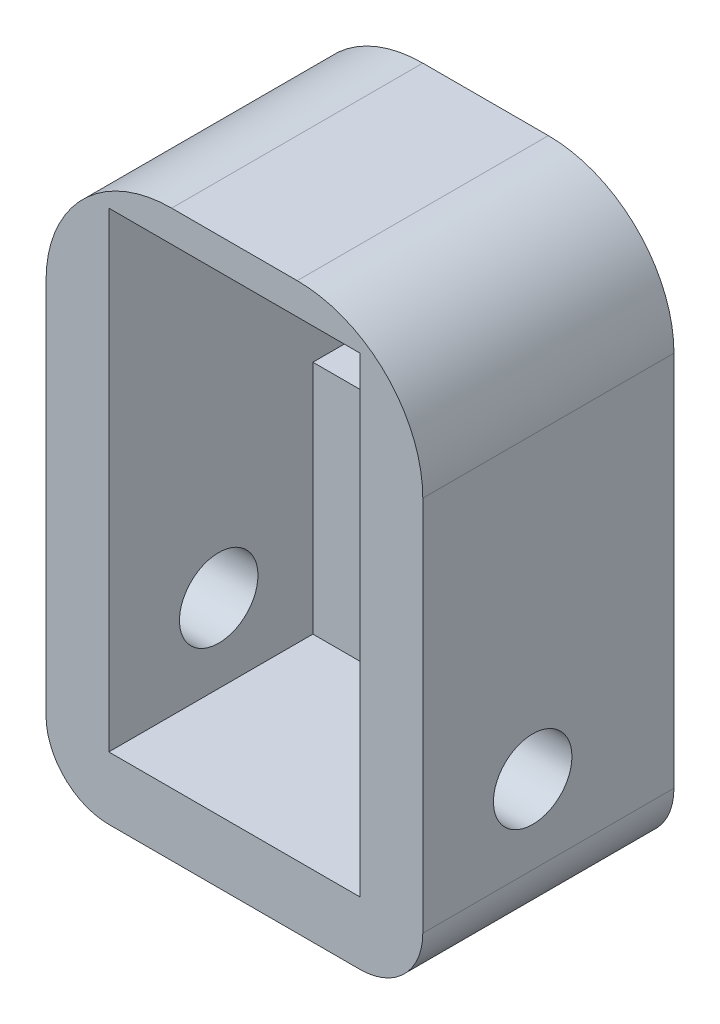
ISO-10303-21;
HEADER;
FILE_DESCRIPTION(('STEP AP214'),'2;1');
FILE_NAME('part.step','',(''),(''),'','','');
FILE_SCHEMA(('AUTOMOTIVE_DESIGN { 1 0 10303 214 1 1 1 1 }'));
ENDSEC;
DATA;
#1=APPLICATION_CONTEXT('core data for automotive mechanical design processes');
#2=APPLICATION_PROTOCOL_DEFINITION('international standard','automotive_design',2000,#1);
#3=PRODUCT_CONTEXT('',#1,'mechanical');
#4=PRODUCT('Part','Part','',(#3));
#5=PRODUCT_RELATED_PRODUCT_CATEGORY('part','',(#4));
#6=PRODUCT_DEFINITION_FORMATION('','',#4);
#7=PRODUCT_DEFINITION_CONTEXT('part definition',#1,'design');
#8=PRODUCT_DEFINITION('design','',#6,#7);
#9=PRODUCT_DEFINITION_SHAPE('','',#8);
#10=(LENGTH_UNIT() NAMED_UNIT(*) SI_UNIT(.MILLI.,.METRE.));
#11=(NAMED_UNIT(*) PLANE_ANGLE_UNIT() SI_UNIT($,.RADIAN.));
#12=(NAMED_UNIT(*) SI_UNIT($,.STERADIAN.) SOLID_ANGLE_UNIT());
#13=UNCERTAINTY_MEASURE_WITH_UNIT(LENGTH_MEASURE(1.E-05),#10,'distance_accuracy_value','');
#14=(GEOMETRIC_REPRESENTATION_CONTEXT(3) GLOBAL_UNCERTAINTY_ASSIGNED_CONTEXT((#13)) GLOBAL_UNIT_ASSIGNED_CONTEXT((#10,
#11,#12)) REPRESENTATION_CONTEXT('',''));
#15=CARTESIAN_POINT('',(0.,0.,0.));
#16=DIRECTION('',(0.,0.,1.));
#17=DIRECTION('',(1.,0.,0.));
#18=AXIS2_PLACEMENT_3D('',#15,#16,#17);
#19=CARTESIAN_POINT('',(0.,0.,8.));
#20=DIRECTION('',(1.,0.,0.));
#21=DIRECTION('',(0.,0.,-1.));
#22=AXIS2_PLACEMENT_3D('',#19,#20,#21);
#23=PLANE('',#22);
#24=CARTESIAN_POINT('',(0.,2.5,4.5));
#25=DIRECTION('',(1.,0.,0.));
#26=DIRECTION('',(0.,0.,-1.));
#27=AXIS2_PLACEMENT_3D('',#24,#25,#26);
#28=CIRCLE('',#27,1.24999999999999);
#29=CARTESIAN_POINT('',(0.,2.5,3.25000000000001));
#30=VERTEX_POINT('',#29);
#31=EDGE_CURVE('E182',#30,#30,#28,.T.);
#32=ORIENTED_EDGE('',*,*,#31,.F.);
#33=EDGE_LOOP('',(#32));
#34=FACE_BOUND('',#33,.T.);
#35=DIRECTION('',(0.,-1.,0.));
#36=VECTOR('',#35,1.);
#37=CARTESIAN_POINT('',(0.,0.,1.5));
#38=LINE('',#37,#36);
#39=CARTESIAN_POINT('',(0.,7.5,1.5));
#40=VERTEX_POINT('',#39);
#41=CARTESIAN_POINT('',(0.,0.,1.5));
#42=VERTEX_POINT('',#41);
#43=EDGE_CURVE('E139',#40,#42,#38,.T.);
#44=ORIENTED_EDGE('',*,*,#43,.F.);
#45=DIRECTION('',(0.,0.,-1.));
#46=VECTOR('',#45,1.);
#47=CARTESIAN_POINT('',(0.,7.5,1.5));
#48=LINE('',#47,#46);
#49=CARTESIAN_POINT('',(0.,7.5,0.));
#50=VERTEX_POINT('',#49);
#51=EDGE_CURVE('E291',#40,#50,#48,.T.);
#52=ORIENTED_EDGE('',*,*,#51,.T.);
#53=DIRECTION('',(0.,-1.,0.));
#54=VECTOR('',#53,1.);
#55=CARTESIAN_POINT('',(0.,0.,0.));
#56=LINE('',#55,#54);
#57=CARTESIAN_POINT('',(0.,15.,0.));
#58=VERTEX_POINT('',#57);
#59=EDGE_CURVE('E243',#58,#50,#56,.T.);
#60=ORIENTED_EDGE('',*,*,#59,.F.);
#61=DIRECTION('',(0.,0.,-1.));
#62=VECTOR('',#61,1.);
#63=CARTESIAN_POINT('',(0.,15.,8.));
#64=LINE('',#63,#62);
#65=CARTESIAN_POINT('',(0.,15.,8.));
#66=VERTEX_POINT('',#65);
#67=EDGE_CURVE('E176',#66,#58,#64,.T.);
#68=ORIENTED_EDGE('',*,*,#67,.F.);
#69=DIRECTION('',(0.,-1.,0.));
#70=VECTOR('',#69,1.);
#71=CARTESIAN_POINT('',(0.,0.,8.));
#72=LINE('',#71,#70);
#73=CARTESIAN_POINT('',(0.,0.,8.));
#74=VERTEX_POINT('',#73);
#75=EDGE_CURVE('E162',#66,#74,#72,.T.);
#76=ORIENTED_EDGE('',*,*,#75,.T.);
#77=DIRECTION('',(0.,0.,-1.));
#78=VECTOR('',#77,1.);
#79=CARTESIAN_POINT('',(0.,0.,8.));
#80=LINE('',#79,#78);
#81=EDGE_CURVE('E156',#74,#42,#80,.T.);
#82=ORIENTED_EDGE('',*,*,#81,.T.);
#83=EDGE_LOOP('',(#44,#52,#60,#68,#76,#82));
#84=FACE_BOUND('',#83,.T.);
#85=ADVANCED_FACE('F39',(#34,#84),#23,.T.);
#86=CARTESIAN_POINT('',(8.,0.,8.));
#87=DIRECTION('',(-1.,0.,0.));
#88=DIRECTION('',(0.,0.,1.));
#89=AXIS2_PLACEMENT_3D('',#86,#87,#88);
#90=PLANE('',#89);
#91=CARTESIAN_POINT('',(8.,2.5,4.5));
#92=DIRECTION('',(-1.,0.,0.));
#93=DIRECTION('',(0.,0.,1.));
#94=AXIS2_PLACEMENT_3D('',#91,#92,#93);
#95=CIRCLE('',#94,1.24999999999999);
#96=CARTESIAN_POINT('',(8.,2.5,5.74999999999999));
#97=VERTEX_POINT('',#96);
#98=EDGE_CURVE('E179',#97,#97,#95,.T.);
#99=ORIENTED_EDGE('',*,*,#98,.F.);
#100=EDGE_LOOP('',(#99));
#101=FACE_BOUND('',#100,.T.);
#102=DIRECTION('',(0.,1.,0.));
#103=VECTOR('',#102,1.);
#104=CARTESIAN_POINT('',(8.,0.,0.));
#105=LINE('',#104,#103);
#106=CARTESIAN_POINT('',(8.,7.5,0.));
#107=VERTEX_POINT('',#106);
#108=CARTESIAN_POINT('',(8.,15.,0.));
#109=VERTEX_POINT('',#108);
#110=EDGE_CURVE('E171',#107,#109,#105,.T.);
#111=ORIENTED_EDGE('',*,*,#110,.F.);
#112=DIRECTION('',(0.,0.,-1.));
#113=VECTOR('',#112,1.);
#114=CARTESIAN_POINT('',(8.,7.5,1.5));
#115=LINE('',#114,#113);
#116=CARTESIAN_POINT('',(8.,7.5,1.5));
#117=VERTEX_POINT('',#116);
#118=EDGE_CURVE('E274',#117,#107,#115,.T.);
#119=ORIENTED_EDGE('',*,*,#118,.F.);
#120=DIRECTION('',(0.,1.,0.));
#121=VECTOR('',#120,1.);
#122=CARTESIAN_POINT('',(8.,0.,1.5));
#123=LINE('',#122,#121);
#124=CARTESIAN_POINT('',(8.,0.,1.5));
#125=VERTEX_POINT('',#124);
#126=EDGE_CURVE('E159',#125,#117,#123,.T.);
#127=ORIENTED_EDGE('',*,*,#126,.F.);
#128=DIRECTION('',(0.,0.,-1.));
#129=VECTOR('',#128,1.);
#130=CARTESIAN_POINT('',(8.,0.,8.));
#131=LINE('',#130,#129);
#132=CARTESIAN_POINT('',(8.,0.,8.));
#133=VERTEX_POINT('',#132);
#134=EDGE_CURVE('E158',#133,#125,#131,.T.);
#135=ORIENTED_EDGE('',*,*,#134,.F.);
#136=DIRECTION('',(0.,1.,0.));
#137=VECTOR('',#136,1.);
#138=CARTESIAN_POINT('',(8.,0.,8.));
#139=LINE('',#138,#137);
#140=CARTESIAN_POINT('',(8.,15.,8.));
#141=VERTEX_POINT('',#140);
#142=EDGE_CURVE('E168',#133,#141,#139,.T.);
#143=ORIENTED_EDGE('',*,*,#142,.T.);
#144=DIRECTION('',(0.,0.,-1.));
#145=VECTOR('',#144,1.);
#146=CARTESIAN_POINT('',(8.,15.,8.));
#147=LINE('',#146,#145);
#148=EDGE_CURVE('E166',#141,#109,#147,.T.);
#149=ORIENTED_EDGE('',*,*,#148,.T.);
#150=EDGE_LOOP('',(#111,#119,#127,#135,#143,#149));
#151=FACE_BOUND('',#150,.T.);
#152=ADVANCED_FACE('F262',(#101,#151),#90,.T.);
#153=CARTESIAN_POINT('',(0.,15.,8.));
#154=DIRECTION('',(0.,1.,0.));
#155=DIRECTION('',(0.,0.,1.));
#156=AXIS2_PLACEMENT_3D('',#153,#154,#155);
#157=PLANE('',#156);
#158=DIRECTION('',(1.,0.,0.));
#159=VECTOR('',#158,1.);
#160=CARTESIAN_POINT('',(0.,15.,0.));
#161=LINE('',#160,#159);
#162=EDGE_CURVE('E247',#58,#109,#161,.T.);
#163=ORIENTED_EDGE('',*,*,#162,.T.);
#164=ORIENTED_EDGE('',*,*,#148,.F.);
#165=DIRECTION('',(1.,0.,0.));
#166=VECTOR('',#165,1.);
#167=CARTESIAN_POINT('',(0.,15.,8.));
#168=LINE('',#167,#166);
#169=EDGE_CURVE('E266',#66,#141,#168,.T.);
#170=ORIENTED_EDGE('',*,*,#169,.F.);
#171=ORIENTED_EDGE('',*,*,#67,.T.);
#172=EDGE_LOOP('',(#163,#164,#170,#171));
#173=FACE_BOUND('',#172,.T.);
#174=ADVANCED_FACE('F265',(#173),#157,.F.);
#175=CARTESIAN_POINT('',(10.,0.,8.));
#176=DIRECTION('',(1.,0.,0.));
#177=DIRECTION('',(0.,0.,-1.));
#178=AXIS2_PLACEMENT_3D('',#175,#176,#177);
#179=PLANE('',#178);
#180=CARTESIAN_POINT('',(10.,2.5,4.5));
#181=DIRECTION('',(1.,0.,0.));
#182=DIRECTION('',(0.,0.,-1.));
#183=AXIS2_PLACEMENT_3D('',#180,#181,#182);
#184=CIRCLE('',#183,1.24999999999999);
#185=CARTESIAN_POINT('',(10.,2.5,3.25000000000001));
#186=VERTEX_POINT('',#185);
#187=EDGE_CURVE('E300',#186,#186,#184,.T.);
#188=ORIENTED_EDGE('',*,*,#187,.F.);
#189=EDGE_LOOP('',(#188));
#190=FACE_BOUND('',#189,.T.);
#191=DIRECTION('',(0.,-1.,0.));
#192=VECTOR('',#191,1.);
#193=CARTESIAN_POINT('',(10.,0.,8.));
#194=LINE('',#193,#192);
#195=CARTESIAN_POINT('',(10.,12.,8.));
#196=VERTEX_POINT('',#195);
#197=CARTESIAN_POINT('',(10.,0.,8.));
#198=VERTEX_POINT('',#197);
#199=EDGE_CURVE('E219',#196,#198,#194,.T.);
#200=ORIENTED_EDGE('',*,*,#199,.T.);
#201=DIRECTION('',(0.,0.,-1.));
#202=VECTOR('',#201,1.);
#203=CARTESIAN_POINT('',(10.,0.,8.));
#204=LINE('',#203,#202);
#205=CARTESIAN_POINT('',(10.,0.,0.));
#206=VERTEX_POINT('',#205);
#207=EDGE_CURVE('E202',#198,#206,#204,.T.);
#208=ORIENTED_EDGE('',*,*,#207,.T.);
#209=DIRECTION('',(0.,-1.,0.));
#210=VECTOR('',#209,1.);
#211=CARTESIAN_POINT('',(10.,0.,0.));
#212=LINE('',#211,#210);
#213=CARTESIAN_POINT('',(10.,12.,0.));
#214=VERTEX_POINT('',#213);
#215=EDGE_CURVE('E239',#214,#206,#212,.T.);
#216=ORIENTED_EDGE('',*,*,#215,.F.);
#217=DIRECTION('',(0.,0.,-1.));
#218=VECTOR('',#217,1.);
#219=CARTESIAN_POINT('',(10.,12.,8.));
#220=LINE('',#219,#218);
#221=EDGE_CURVE('E192',#214,#196,#220,.F.);
#222=ORIENTED_EDGE('',*,*,#221,.T.);
#223=EDGE_LOOP('',(#200,#208,#216,#222));
#224=FACE_BOUND('',#223,.T.);
#225=ADVANCED_FACE('F226',(#190,#224),#179,.T.);
#226=CARTESIAN_POINT('',(0.,16.,8.));
#227=DIRECTION('',(0.,1.,0.));
#228=DIRECTION('',(0.,0.,1.));
#229=AXIS2_PLACEMENT_3D('',#226,#227,#228);
#230=PLANE('',#229);
#231=DIRECTION('',(1.,0.,0.));
#232=VECTOR('',#231,1.);
#233=CARTESIAN_POINT('',(0.,16.,8.));
#234=LINE('',#233,#232);
#235=CARTESIAN_POINT('',(2.,16.,8.));
#236=VERTEX_POINT('',#235);
#237=CARTESIAN_POINT('',(6.,16.,8.));
#238=VERTEX_POINT('',#237);
#239=EDGE_CURVE('E230',#236,#238,#234,.T.);
#240=ORIENTED_EDGE('',*,*,#239,.T.);
#241=DIRECTION('',(0.,0.,-1.));
#242=VECTOR('',#241,1.);
#243=CARTESIAN_POINT('',(6.,16.,8.));
#244=LINE('',#243,#242);
#245=CARTESIAN_POINT('',(6.,16.,0.));
#246=VERTEX_POINT('',#245);
#247=EDGE_CURVE('E185',#238,#246,#244,.T.);
#248=ORIENTED_EDGE('',*,*,#247,.T.);
#249=DIRECTION('',(1.,0.,0.));
#250=VECTOR('',#249,1.);
#251=CARTESIAN_POINT('',(0.,16.,0.));
#252=LINE('',#251,#250);
#253=CARTESIAN_POINT('',(2.,16.,0.));
#254=VERTEX_POINT('',#253);
#255=EDGE_CURVE('E249',#254,#246,#252,.T.);
#256=ORIENTED_EDGE('',*,*,#255,.F.);
#257=DIRECTION('',(0.,0.,-1.));
#258=VECTOR('',#257,1.);
#259=CARTESIAN_POINT('',(2.,16.,8.));
#260=LINE('',#259,#258);
#261=EDGE_CURVE('E178',#254,#236,#260,.F.);
#262=ORIENTED_EDGE('',*,*,#261,.T.);
#263=EDGE_LOOP('',(#240,#248,#256,#262));
#264=FACE_BOUND('',#263,.T.);
#265=ADVANCED_FACE('F281',(#264),#230,.T.);
#266=CARTESIAN_POINT('',(-2.,0.,8.));
#267=DIRECTION('',(-1.,0.,0.));
#268=DIRECTION('',(0.,0.,1.));
#269=AXIS2_PLACEMENT_3D('',#266,#267,#268);
#270=PLANE('',#269);
#271=CARTESIAN_POINT('',(-2.,2.5,4.5));
#272=DIRECTION('',(1.,0.,0.));
#273=DIRECTION('',(0.,0.,-1.));
#274=AXIS2_PLACEMENT_3D('',#271,#272,#273);
#275=CIRCLE('',#274,1.25);
#276=CARTESIAN_POINT('',(-2.,2.5,3.25));
#277=VERTEX_POINT('',#276);
#278=EDGE_CURVE('E183',#277,#277,#275,.T.);
#279=ORIENTED_EDGE('',*,*,#278,.T.);
#280=EDGE_LOOP('',(#279));
#281=FACE_BOUND('',#280,.T.);
#282=DIRECTION('',(0.,1.,0.));
#283=VECTOR('',#282,1.);
#284=CARTESIAN_POINT('',(-2.,0.,0.));
#285=LINE('',#284,#283);
#286=CARTESIAN_POINT('',(-2.,0.,0.));
#287=VERTEX_POINT('',#286);
#288=CARTESIAN_POINT('',(-2.,12.,0.));
#289=VERTEX_POINT('',#288);
#290=EDGE_CURVE('E244',#287,#289,#285,.T.);
#291=ORIENTED_EDGE('',*,*,#290,.F.);
#292=DIRECTION('',(0.,0.,-1.));
#293=VECTOR('',#292,1.);
#294=CARTESIAN_POINT('',(-2.,0.,8.));
#295=LINE('',#294,#293);
#296=CARTESIAN_POINT('',(-2.,0.,8.));
#297=VERTEX_POINT('',#296);
#298=EDGE_CURVE('E11',#287,#297,#295,.F.);
#299=ORIENTED_EDGE('',*,*,#298,.T.);
#300=DIRECTION('',(0.,1.,0.));
#301=VECTOR('',#300,1.);
#302=CARTESIAN_POINT('',(-2.,0.,8.));
#303=LINE('',#302,#301);
#304=CARTESIAN_POINT('',(-2.,12.,8.));
#305=VERTEX_POINT('',#304);
#306=EDGE_CURVE('E269',#297,#305,#303,.T.);
#307=ORIENTED_EDGE('',*,*,#306,.T.);
#308=DIRECTION('',(0.,0.,-1.));
#309=VECTOR('',#308,1.);
#310=CARTESIAN_POINT('',(-2.,12.,8.));
#311=LINE('',#310,#309);
#312=EDGE_CURVE('E199',#305,#289,#311,.T.);
#313=ORIENTED_EDGE('',*,*,#312,.T.);
#314=EDGE_LOOP('',(#291,#299,#307,#313));
#315=FACE_BOUND('',#314,.T.);
#316=ADVANCED_FACE('F312',(#281,#315),#270,.T.);
#317=CARTESIAN_POINT('',(0.,-2.,8.));
#318=DIRECTION('',(0.,-1.,0.));
#319=DIRECTION('',(0.,0.,-1.));
#320=AXIS2_PLACEMENT_3D('',#317,#318,#319);
#321=PLANE('',#320);
#322=DIRECTION('',(-1.,0.,0.));
#323=VECTOR('',#322,1.);
#324=CARTESIAN_POINT('',(0.,-2.,0.));
#325=LINE('',#324,#323);
#326=CARTESIAN_POINT('',(8.,-2.,0.));
#327=VERTEX_POINT('',#326);
#328=CARTESIAN_POINT('',(0.,-2.,0.));
#329=VERTEX_POINT('',#328);
#330=EDGE_CURVE('E238',#327,#329,#325,.T.);
#331=ORIENTED_EDGE('',*,*,#330,.F.);
#332=DIRECTION('',(0.,0.,-1.));
#333=VECTOR('',#332,1.);
#334=CARTESIAN_POINT('',(8.,-2.,8.));
#335=LINE('',#334,#333);
#336=CARTESIAN_POINT('',(8.,-2.,8.));
#337=VERTEX_POINT('',#336);
#338=EDGE_CURVE('E212',#327,#337,#335,.F.);
#339=ORIENTED_EDGE('',*,*,#338,.T.);
#340=DIRECTION('',(-1.,0.,0.));
#341=VECTOR('',#340,1.);
#342=CARTESIAN_POINT('',(0.,-2.,8.));
#343=LINE('',#342,#341);
#344=CARTESIAN_POINT('',(0.,-2.,8.));
#345=VERTEX_POINT('',#344);
#346=EDGE_CURVE('E221',#337,#345,#343,.T.);
#347=ORIENTED_EDGE('',*,*,#346,.T.);
#348=DIRECTION('',(0.,0.,-1.));
#349=VECTOR('',#348,1.);
#350=CARTESIAN_POINT('',(0.,-2.,8.));
#351=LINE('',#350,#349);
#352=EDGE_CURVE('E209',#345,#329,#351,.T.);
#353=ORIENTED_EDGE('',*,*,#352,.T.);
#354=EDGE_LOOP('',(#331,#339,#347,#353));
#355=FACE_BOUND('',#354,.T.);
#356=ADVANCED_FACE('F241',(#355),#321,.T.);
#357=CARTESIAN_POINT('',(0.,0.,8.));
#358=DIRECTION('',(0.,1.,0.));
#359=DIRECTION('',(0.,0.,1.));
#360=AXIS2_PLACEMENT_3D('',#357,#358,#359);
#361=PLANE('',#360);
#362=DIRECTION('',(1.,0.,0.));
#363=VECTOR('',#362,1.);
#364=CARTESIAN_POINT('',(0.,0.,1.5));
#365=LINE('',#364,#363);
#366=EDGE_CURVE('E142',#42,#125,#365,.T.);
#367=ORIENTED_EDGE('',*,*,#366,.F.);
#368=ORIENTED_EDGE('',*,*,#81,.F.);
#369=DIRECTION('',(1.,0.,0.));
#370=VECTOR('',#369,1.);
#371=CARTESIAN_POINT('',(0.,0.,8.));
#372=LINE('',#371,#370);
#373=EDGE_CURVE('E164',#74,#133,#372,.T.);
#374=ORIENTED_EDGE('',*,*,#373,.T.);
#375=ORIENTED_EDGE('',*,*,#134,.T.);
#376=EDGE_LOOP('',(#367,#368,#374,#375));
#377=FACE_BOUND('',#376,.T.);
#378=ADVANCED_FACE('F154',(#377),#361,.T.);
#379=CARTESIAN_POINT('',(0.,0.,8.));
#380=DIRECTION('',(0.,0.,1.));
#381=DIRECTION('',(1.,0.,0.));
#382=AXIS2_PLACEMENT_3D('',#379,#380,#381);
#383=PLANE('',#382);
#384=ORIENTED_EDGE('',*,*,#346,.F.);
#385=CARTESIAN_POINT('',(8.,0.,8.));
#386=DIRECTION('',(0.,0.,1.));
#387=DIRECTION('',(1.,0.,0.));
#388=AXIS2_PLACEMENT_3D('',#385,#386,#387);
#389=CIRCLE('',#388,2.);
#390=EDGE_CURVE('E47',#337,#198,#389,.T.);
#391=ORIENTED_EDGE('',*,*,#390,.T.);
#392=ORIENTED_EDGE('',*,*,#199,.F.);
#393=CARTESIAN_POINT('',(6.,12.,8.));
#394=DIRECTION('',(0.,0.,1.));
#395=DIRECTION('',(1.,0.,0.));
#396=AXIS2_PLACEMENT_3D('',#393,#394,#395);
#397=CIRCLE('',#396,4.);
#398=EDGE_CURVE('E197',#196,#238,#397,.T.);
#399=ORIENTED_EDGE('',*,*,#398,.T.);
#400=ORIENTED_EDGE('',*,*,#239,.F.);
#401=CARTESIAN_POINT('',(2.,12.,8.));
#402=DIRECTION('',(0.,0.,1.));
#403=DIRECTION('',(1.,0.,0.));
#404=AXIS2_PLACEMENT_3D('',#401,#402,#403);
#405=CIRCLE('',#404,4.);
#406=EDGE_CURVE('E194',#236,#305,#405,.T.);
#407=ORIENTED_EDGE('',*,*,#406,.T.);
#408=ORIENTED_EDGE('',*,*,#306,.F.);
#409=CARTESIAN_POINT('',(0.,0.,8.));
#410=DIRECTION('',(0.,0.,1.));
#411=DIRECTION('',(1.,0.,0.));
#412=AXIS2_PLACEMENT_3D('',#409,#410,#411);
#413=CIRCLE('',#412,2.);
#414=EDGE_CURVE('E59',#297,#345,#413,.T.);
#415=ORIENTED_EDGE('',*,*,#414,.T.);
#416=EDGE_LOOP('',(#384,#391,#392,#399,#400,#407,#408,#415));
#417=FACE_BOUND('',#416,.T.);
#418=ORIENTED_EDGE('',*,*,#75,.F.);
#419=ORIENTED_EDGE('',*,*,#169,.T.);
#420=ORIENTED_EDGE('',*,*,#142,.F.);
#421=ORIENTED_EDGE('',*,*,#373,.F.);
#422=EDGE_LOOP('',(#418,#419,#420,#421));
#423=FACE_BOUND('',#422,.T.);
#424=ADVANCED_FACE('F217',(#417,#423),#383,.T.);
#425=CARTESIAN_POINT('',(0.,0.,0.));
#426=DIRECTION('',(0.,0.,1.));
#427=DIRECTION('',(1.,0.,0.));
#428=AXIS2_PLACEMENT_3D('',#425,#426,#427);
#429=PLANE('',#428);
#430=ORIENTED_EDGE('',*,*,#215,.T.);
#431=CARTESIAN_POINT('',(8.,0.,0.));
#432=DIRECTION('',(0.,0.,1.));
#433=DIRECTION('',(1.,0.,0.));
#434=AXIS2_PLACEMENT_3D('',#431,#432,#433);
#435=CIRCLE('',#434,2.);
#436=EDGE_CURVE('E207',#206,#327,#435,.F.);
#437=ORIENTED_EDGE('',*,*,#436,.T.);
#438=ORIENTED_EDGE('',*,*,#330,.T.);
#439=CARTESIAN_POINT('',(0.,0.,0.));
#440=DIRECTION('',(0.,0.,1.));
#441=DIRECTION('',(1.,0.,0.));
#442=AXIS2_PLACEMENT_3D('',#439,#440,#441);
#443=CIRCLE('',#442,2.);
#444=EDGE_CURVE('E205',#329,#287,#443,.F.);
#445=ORIENTED_EDGE('',*,*,#444,.T.);
#446=ORIENTED_EDGE('',*,*,#290,.T.);
#447=CARTESIAN_POINT('',(2.,12.,0.));
#448=DIRECTION('',(0.,0.,1.));
#449=DIRECTION('',(1.,0.,0.));
#450=AXIS2_PLACEMENT_3D('',#447,#448,#449);
#451=CIRCLE('',#450,4.);
#452=EDGE_CURVE('E188',#289,#254,#451,.F.);
#453=ORIENTED_EDGE('',*,*,#452,.T.);
#454=ORIENTED_EDGE('',*,*,#255,.T.);
#455=CARTESIAN_POINT('',(6.,12.,0.));
#456=DIRECTION('',(0.,0.,1.));
#457=DIRECTION('',(1.,0.,0.));
#458=AXIS2_PLACEMENT_3D('',#455,#456,#457);
#459=CIRCLE('',#458,4.);
#460=EDGE_CURVE('E190',#246,#214,#459,.F.);
#461=ORIENTED_EDGE('',*,*,#460,.T.);
#462=EDGE_LOOP('',(#430,#437,#438,#445,#446,#453,#454,#461));
#463=FACE_BOUND('',#462,.T.);
#464=ORIENTED_EDGE('',*,*,#59,.T.);
#465=DIRECTION('',(-1.,0.,0.));
#466=VECTOR('',#465,1.);
#467=CARTESIAN_POINT('',(0.,7.5,0.));
#468=LINE('',#467,#466);
#469=EDGE_CURVE('E150',#107,#50,#468,.T.);
#470=ORIENTED_EDGE('',*,*,#469,.F.);
#471=ORIENTED_EDGE('',*,*,#110,.T.);
#472=ORIENTED_EDGE('',*,*,#162,.F.);
#473=EDGE_LOOP('',(#464,#470,#471,#472));
#474=FACE_BOUND('',#473,.T.);
#475=ADVANCED_FACE('F236',(#463,#474),#429,.F.);
#476=CARTESIAN_POINT('',(0.,7.5,1.5));
#477=DIRECTION('',(0.,-1.,0.));
#478=DIRECTION('',(0.,0.,-1.));
#479=AXIS2_PLACEMENT_3D('',#476,#477,#478);
#480=PLANE('',#479);
#481=ORIENTED_EDGE('',*,*,#469,.T.);
#482=ORIENTED_EDGE('',*,*,#51,.F.);
#483=DIRECTION('',(-1.,0.,0.));
#484=VECTOR('',#483,1.);
#485=CARTESIAN_POINT('',(0.,7.5,1.5));
#486=LINE('',#485,#484);
#487=EDGE_CURVE('E145',#117,#40,#486,.T.);
#488=ORIENTED_EDGE('',*,*,#487,.F.);
#489=ORIENTED_EDGE('',*,*,#118,.T.);
#490=EDGE_LOOP('',(#481,#482,#488,#489));
#491=FACE_BOUND('',#490,.T.);
#492=ADVANCED_FACE('F359',(#491),#480,.F.);
#493=CARTESIAN_POINT('',(0.,0.,1.5));
#494=DIRECTION('',(0.,0.,1.));
#495=DIRECTION('',(1.,0.,0.));
#496=AXIS2_PLACEMENT_3D('',#493,#494,#495);
#497=PLANE('',#496);
#498=ORIENTED_EDGE('',*,*,#43,.T.);
#499=ORIENTED_EDGE('',*,*,#366,.T.);
#500=ORIENTED_EDGE('',*,*,#126,.T.);
#501=ORIENTED_EDGE('',*,*,#487,.T.);
#502=EDGE_LOOP('',(#498,#499,#500,#501));
#503=FACE_BOUND('',#502,.T.);
#504=ADVANCED_FACE('F141',(#503),#497,.T.);
#505=CARTESIAN_POINT('',(10.,2.5,4.5));
#506=DIRECTION('',(1.,0.,0.));
#507=DIRECTION('',(0.,0.,-1.));
#508=AXIS2_PLACEMENT_3D('',#505,#506,#507);
#509=CYLINDRICAL_SURFACE('',#508,1.24999999999999);
#510=ORIENTED_EDGE('',*,*,#98,.T.);
#511=EDGE_LOOP('',(#510));
#512=FACE_BOUND('',#511,.T.);
#513=ORIENTED_EDGE('',*,*,#187,.T.);
#514=EDGE_LOOP('',(#513));
#515=FACE_BOUND('',#514,.T.);
#516=ADVANCED_FACE('F304',(#512,#515),#509,.F.);
#517=ORIENTED_EDGE('',*,*,#31,.T.);
#518=EDGE_LOOP('',(#517));
#519=FACE_BOUND('',#518,.T.);
#520=ORIENTED_EDGE('',*,*,#278,.F.);
#521=EDGE_LOOP('',(#520));
#522=FACE_BOUND('',#521,.T.);
#523=ADVANCED_FACE('F344',(#519,#522),#509,.F.);
#524=CARTESIAN_POINT('',(6.,12.,8.));
#525=DIRECTION('',(0.,0.,-1.));
#526=DIRECTION('',(-1.,0.,0.));
#527=AXIS2_PLACEMENT_3D('',#524,#525,#526);
#528=CYLINDRICAL_SURFACE('',#527,4.);
#529=ORIENTED_EDGE('',*,*,#398,.F.);
#530=ORIENTED_EDGE('',*,*,#221,.F.);
#531=ORIENTED_EDGE('',*,*,#460,.F.);
#532=ORIENTED_EDGE('',*,*,#247,.F.);
#533=EDGE_LOOP('',(#529,#530,#531,#532));
#534=FACE_BOUND('',#533,.T.);
#535=ADVANCED_FACE('F341',(#534),#528,.T.);
#536=CARTESIAN_POINT('',(2.,12.,8.));
#537=DIRECTION('',(0.,0.,-1.));
#538=DIRECTION('',(-1.,0.,0.));
#539=AXIS2_PLACEMENT_3D('',#536,#537,#538);
#540=CYLINDRICAL_SURFACE('',#539,4.);
#541=ORIENTED_EDGE('',*,*,#406,.F.);
#542=ORIENTED_EDGE('',*,*,#261,.F.);
#543=ORIENTED_EDGE('',*,*,#452,.F.);
#544=ORIENTED_EDGE('',*,*,#312,.F.);
#545=EDGE_LOOP('',(#541,#542,#543,#544));
#546=FACE_BOUND('',#545,.T.);
#547=ADVANCED_FACE('F286',(#546),#540,.T.);
#548=CARTESIAN_POINT('',(8.,0.,8.));
#549=DIRECTION('',(0.,0.,-1.));
#550=DIRECTION('',(-1.,0.,0.));
#551=AXIS2_PLACEMENT_3D('',#548,#549,#550);
#552=CYLINDRICAL_SURFACE('',#551,2.);
#553=ORIENTED_EDGE('',*,*,#390,.F.);
#554=ORIENTED_EDGE('',*,*,#338,.F.);
#555=ORIENTED_EDGE('',*,*,#436,.F.);
#556=ORIENTED_EDGE('',*,*,#207,.F.);
#557=EDGE_LOOP('',(#553,#554,#555,#556));
#558=FACE_BOUND('',#557,.T.);
#559=ADVANCED_FACE('F232',(#558),#552,.T.);
#560=CARTESIAN_POINT('',(0.,0.,8.));
#561=DIRECTION('',(0.,0.,-1.));
#562=DIRECTION('',(-1.,0.,0.));
#563=AXIS2_PLACEMENT_3D('',#560,#561,#562);
#564=CYLINDRICAL_SURFACE('',#563,2.);
#565=ORIENTED_EDGE('',*,*,#414,.F.);
#566=ORIENTED_EDGE('',*,*,#298,.F.);
#567=ORIENTED_EDGE('',*,*,#444,.F.);
#568=ORIENTED_EDGE('',*,*,#352,.F.);
#569=EDGE_LOOP('',(#565,#566,#567,#568));
#570=FACE_BOUND('',#569,.T.);
#571=ADVANCED_FACE('F41',(#570),#564,.T.);
#572=CLOSED_SHELL('',(#85,#152,#174,#225,#265,#316,#356,#378,#424,#475,#492,#504,#516,#523,#535,
#547,#559,#571));
#573=MANIFOLD_SOLID_BREP('B2',#572);
#574=ADVANCED_BREP_SHAPE_REPRESENTATION('',(#18,#573),#14);
#575=SHAPE_DEFINITION_REPRESENTATION(#9,#574);
ENDSEC;
END-ISO-10303-21;
